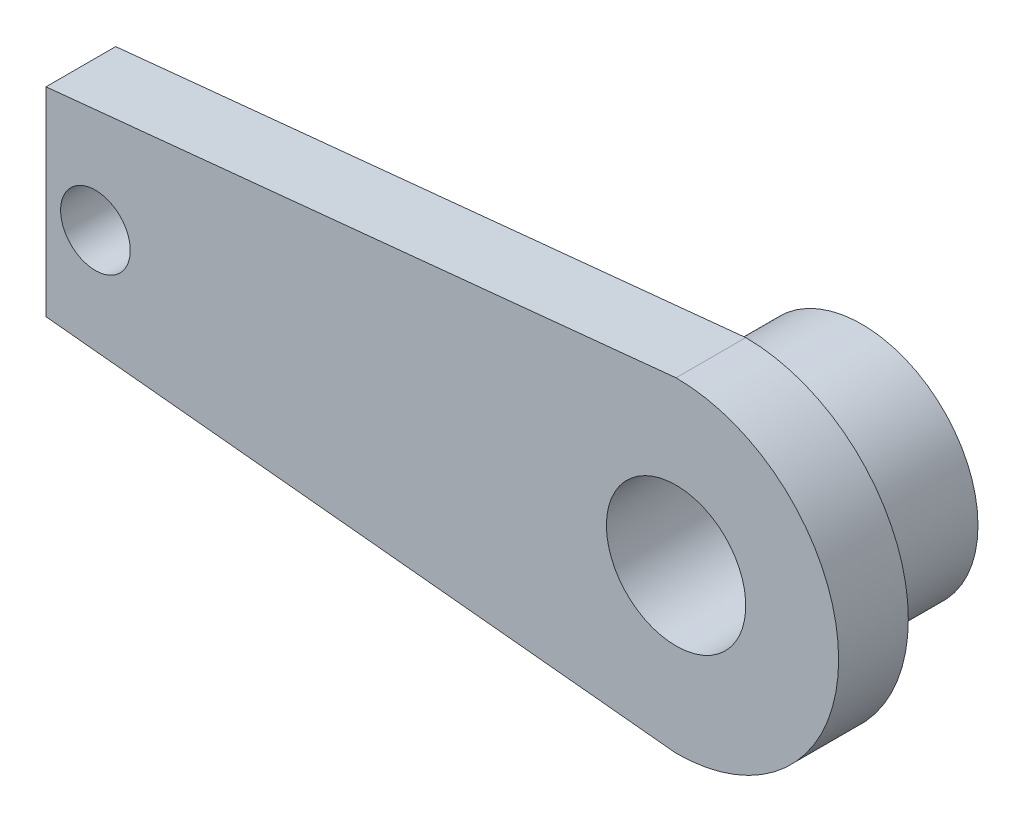
ISO-10303-21;
HEADER;
FILE_DESCRIPTION(('STEP AP214'),'2;1');
FILE_NAME('part.step','',(''),(''),'','','');
FILE_SCHEMA(('AUTOMOTIVE_DESIGN { 1 0 10303 214 1 1 1 1 }'));
ENDSEC;
DATA;
#1=APPLICATION_CONTEXT('core data for automotive mechanical design processes');
#2=APPLICATION_PROTOCOL_DEFINITION('international standard','automotive_design',2000,#1);
#3=PRODUCT_CONTEXT('',#1,'mechanical');
#4=PRODUCT('Part','Part','',(#3));
#5=PRODUCT_RELATED_PRODUCT_CATEGORY('part','',(#4));
#6=PRODUCT_DEFINITION_FORMATION('','',#4);
#7=PRODUCT_DEFINITION_CONTEXT('part definition',#1,'design');
#8=PRODUCT_DEFINITION('design','',#6,#7);
#9=PRODUCT_DEFINITION_SHAPE('','',#8);
#10=(LENGTH_UNIT() NAMED_UNIT(*) SI_UNIT(.MILLI.,.METRE.));
#11=(NAMED_UNIT(*) PLANE_ANGLE_UNIT() SI_UNIT($,.RADIAN.));
#12=(NAMED_UNIT(*) SI_UNIT($,.STERADIAN.) SOLID_ANGLE_UNIT());
#13=UNCERTAINTY_MEASURE_WITH_UNIT(LENGTH_MEASURE(1.E-05),#10,'distance_accuracy_value','');
#14=(GEOMETRIC_REPRESENTATION_CONTEXT(3) GLOBAL_UNCERTAINTY_ASSIGNED_CONTEXT((#13)) GLOBAL_UNIT_ASSIGNED_CONTEXT((#10,
#11,#12)) REPRESENTATION_CONTEXT('',''));
#15=CARTESIAN_POINT('',(0.,0.,0.));
#16=DIRECTION('',(0.,0.,1.));
#17=DIRECTION('',(1.,0.,0.));
#18=AXIS2_PLACEMENT_3D('',#15,#16,#17);
#19=CARTESIAN_POINT('',(-30.,-4.,8.));
#20=DIRECTION('',(0.099503719020999,0.995037190209989,0.));
#21=DIRECTION('',(-0.995037190209989,0.099503719020999,0.));
#22=AXIS2_PLACEMENT_3D('',#19,#20,#21);
#23=PLANE('',#22);
#24=DIRECTION('',(0.,0.,-1.));
#25=VECTOR('',#24,1.);
#26=CARTESIAN_POINT('',(-27.1280270584127,-4.28719729415873,15.));
#27=LINE('',#26,#25);
#28=CARTESIAN_POINT('',(-27.1280270584127,-4.28719729415873,8.));
#29=VERTEX_POINT('',#28);
#30=CARTESIAN_POINT('',(-27.1280270584127,-4.28719729415873,5.));
#31=VERTEX_POINT('',#30);
#32=EDGE_CURVE('E151',#29,#31,#27,.T.);
#33=ORIENTED_EDGE('',*,*,#32,.T.);
#34=DIRECTION('',(0.995037190209989,-0.0995037190209989,0.));
#35=VECTOR('',#34,1.);
#36=CARTESIAN_POINT('',(-30.,-4.,5.));
#37=LINE('',#36,#35);
#38=CARTESIAN_POINT('',(0.,-7.,5.));
#39=VERTEX_POINT('',#38);
#40=EDGE_CURVE('E80',#31,#39,#37,.T.);
#41=ORIENTED_EDGE('',*,*,#40,.T.);
#42=DIRECTION('',(0.,0.,-1.));
#43=VECTOR('',#42,1.);
#44=CARTESIAN_POINT('',(0.,-7.,8.));
#45=LINE('',#44,#43);
#46=CARTESIAN_POINT('',(0.,-7.,8.));
#47=VERTEX_POINT('',#46);
#48=EDGE_CURVE('E75',#47,#39,#45,.T.);
#49=ORIENTED_EDGE('',*,*,#48,.F.);
#50=DIRECTION('',(0.995037190209989,-0.0995037190209989,0.));
#51=VECTOR('',#50,1.);
#52=CARTESIAN_POINT('',(-30.,-4.,8.));
#53=LINE('',#52,#51);
#54=EDGE_CURVE('E89',#29,#47,#53,.T.);
#55=ORIENTED_EDGE('',*,*,#54,.F.);
#56=EDGE_LOOP('',(#33,#41,#49,#55));
#57=FACE_BOUND('',#56,.T.);
#58=ADVANCED_FACE('F32',(#57),#23,.F.);
#59=CARTESIAN_POINT('',(-30.,4.,8.));
#60=DIRECTION('',(0.099503719020999,-0.995037190209989,0.));
#61=DIRECTION('',(0.995037190209989,0.099503719020999,0.));
#62=AXIS2_PLACEMENT_3D('',#59,#60,#61);
#63=PLANE('',#62);
#64=DIRECTION('',(0.,0.,-1.));
#65=VECTOR('',#64,1.);
#66=CARTESIAN_POINT('',(-27.1280270584127,4.28719729415873,15.));
#67=LINE('',#66,#65);
#68=CARTESIAN_POINT('',(-27.1280270584127,4.28719729415873,8.));
#69=VERTEX_POINT('',#68);
#70=CARTESIAN_POINT('',(-27.1280270584127,4.28719729415873,5.));
#71=VERTEX_POINT('',#70);
#72=EDGE_CURVE('E47',#69,#71,#67,.T.);
#73=ORIENTED_EDGE('',*,*,#72,.F.);
#74=DIRECTION('',(-0.995037190209989,-0.0995037190209989,0.));
#75=VECTOR('',#74,1.);
#76=CARTESIAN_POINT('',(-30.,4.,8.));
#77=LINE('',#76,#75);
#78=CARTESIAN_POINT('',(0.,7.,8.));
#79=VERTEX_POINT('',#78);
#80=EDGE_CURVE('E85',#79,#69,#77,.T.);
#81=ORIENTED_EDGE('',*,*,#80,.F.);
#82=DIRECTION('',(0.,0.,-1.));
#83=VECTOR('',#82,1.);
#84=CARTESIAN_POINT('',(0.,7.,8.));
#85=LINE('',#84,#83);
#86=CARTESIAN_POINT('',(0.,7.,5.));
#87=VERTEX_POINT('',#86);
#88=EDGE_CURVE('E72',#79,#87,#85,.T.);
#89=ORIENTED_EDGE('',*,*,#88,.T.);
#90=DIRECTION('',(-0.995037190209989,-0.0995037190209989,0.));
#91=VECTOR('',#90,1.);
#92=CARTESIAN_POINT('',(-30.,4.,5.));
#93=LINE('',#92,#91);
#94=EDGE_CURVE('E79',#87,#71,#93,.T.);
#95=ORIENTED_EDGE('',*,*,#94,.T.);
#96=EDGE_LOOP('',(#73,#81,#89,#95));
#97=FACE_BOUND('',#96,.T.);
#98=ADVANCED_FACE('F84',(#97),#63,.F.);
#99=CARTESIAN_POINT('',(-30.,0.,8.));
#100=DIRECTION('',(0.,0.,1.));
#101=DIRECTION('',(1.,0.,0.));
#102=AXIS2_PLACEMENT_3D('',#99,#100,#101);
#103=PLANE('',#102);
#104=CARTESIAN_POINT('',(0.,0.,8.));
#105=DIRECTION('',(0.,0.,-1.));
#106=DIRECTION('',(-1.,0.,0.));
#107=AXIS2_PLACEMENT_3D('',#104,#105,#106);
#108=CIRCLE('',#107,3.);
#109=CARTESIAN_POINT('',(-3.,0.,8.));
#110=VERTEX_POINT('',#109);
#111=EDGE_CURVE('E133',#110,#110,#108,.T.);
#112=ORIENTED_EDGE('',*,*,#111,.T.);
#113=EDGE_LOOP('',(#112));
#114=FACE_BOUND('',#113,.T.);
#115=CARTESIAN_POINT('',(-25.,0.,8.));
#116=DIRECTION('',(0.,0.,-1.));
#117=DIRECTION('',(-1.,0.,0.));
#118=AXIS2_PLACEMENT_3D('',#115,#116,#117);
#119=CIRCLE('',#118,1.5);
#120=CARTESIAN_POINT('',(-26.5,0.,8.));
#121=VERTEX_POINT('',#120);
#122=EDGE_CURVE('E139',#121,#121,#119,.T.);
#123=ORIENTED_EDGE('',*,*,#122,.T.);
#124=EDGE_LOOP('',(#123));
#125=FACE_BOUND('',#124,.T.);
#126=ORIENTED_EDGE('',*,*,#80,.T.);
#127=DIRECTION('',(0.,-1.,0.));
#128=VECTOR('',#127,1.);
#129=CARTESIAN_POINT('',(-27.1280270584127,0.,8.));
#130=LINE('',#129,#128);
#131=EDGE_CURVE('E136',#69,#29,#130,.T.);
#132=ORIENTED_EDGE('',*,*,#131,.T.);
#133=ORIENTED_EDGE('',*,*,#54,.T.);
#134=CARTESIAN_POINT('',(0.,0.,8.));
#135=DIRECTION('',(0.,0.,1.));
#136=DIRECTION('',(1.,0.,0.));
#137=AXIS2_PLACEMENT_3D('',#134,#135,#136);
#138=CIRCLE('',#137,7.);
#139=EDGE_CURVE('E56',#47,#79,#138,.T.);
#140=ORIENTED_EDGE('',*,*,#139,.T.);
#141=EDGE_LOOP('',(#126,#132,#133,#140));
#142=FACE_BOUND('',#141,.T.);
#143=ADVANCED_FACE('F111',(#114,#125,#142),#103,.T.);
#144=CARTESIAN_POINT('',(-30.,0.,5.));
#145=DIRECTION('',(0.,0.,1.));
#146=DIRECTION('',(1.,0.,0.));
#147=AXIS2_PLACEMENT_3D('',#144,#145,#146);
#148=PLANE('',#147);
#149=CARTESIAN_POINT('',(0.,0.,5.));
#150=DIRECTION('',(0.,0.,1.));
#151=DIRECTION('',(1.,0.,0.));
#152=AXIS2_PLACEMENT_3D('',#149,#150,#151);
#153=CIRCLE('',#152,5.);
#154=CARTESIAN_POINT('',(5.,0.,5.));
#155=VERTEX_POINT('',#154);
#156=EDGE_CURVE('E11',#155,#155,#153,.T.);
#157=ORIENTED_EDGE('',*,*,#156,.T.);
#158=EDGE_LOOP('',(#157));
#159=FACE_BOUND('',#158,.T.);
#160=CARTESIAN_POINT('',(-25.,0.,5.));
#161=DIRECTION('',(0.,0.,-1.));
#162=DIRECTION('',(-1.,0.,0.));
#163=AXIS2_PLACEMENT_3D('',#160,#161,#162);
#164=CIRCLE('',#163,1.5);
#165=CARTESIAN_POINT('',(-26.5,0.,5.));
#166=VERTEX_POINT('',#165);
#167=EDGE_CURVE('E135',#166,#166,#164,.T.);
#168=ORIENTED_EDGE('',*,*,#167,.F.);
#169=EDGE_LOOP('',(#168));
#170=FACE_BOUND('',#169,.T.);
#171=DIRECTION('',(0.,1.,0.));
#172=VECTOR('',#171,1.);
#173=CARTESIAN_POINT('',(-27.1280270584127,0.,5.));
#174=LINE('',#173,#172);
#175=EDGE_CURVE('E88',#31,#71,#174,.T.);
#176=ORIENTED_EDGE('',*,*,#175,.T.);
#177=ORIENTED_EDGE('',*,*,#94,.F.);
#178=CARTESIAN_POINT('',(0.,0.,5.));
#179=DIRECTION('',(0.,0.,1.));
#180=DIRECTION('',(1.,0.,0.));
#181=AXIS2_PLACEMENT_3D('',#178,#179,#180);
#182=CIRCLE('',#181,7.);
#183=EDGE_CURVE('E69',#39,#87,#182,.T.);
#184=ORIENTED_EDGE('',*,*,#183,.F.);
#185=ORIENTED_EDGE('',*,*,#40,.F.);
#186=EDGE_LOOP('',(#176,#177,#184,#185));
#187=FACE_BOUND('',#186,.T.);
#188=ADVANCED_FACE('F87',(#159,#170,#187),#148,.F.);
#189=CARTESIAN_POINT('',(0.,0.,0.));
#190=DIRECTION('',(0.,0.,1.));
#191=DIRECTION('',(1.,0.,0.));
#192=AXIS2_PLACEMENT_3D('',#189,#190,#191);
#193=PLANE('',#192);
#194=CARTESIAN_POINT('',(0.,0.,0.));
#195=DIRECTION('',(0.,0.,1.));
#196=DIRECTION('',(1.,0.,0.));
#197=AXIS2_PLACEMENT_3D('',#194,#195,#196);
#198=CIRCLE('',#197,5.);
#199=CARTESIAN_POINT('',(5.,0.,0.));
#200=VERTEX_POINT('',#199);
#201=EDGE_CURVE('E36',#200,#200,#198,.T.);
#202=ORIENTED_EDGE('',*,*,#201,.F.);
#203=EDGE_LOOP('',(#202));
#204=FACE_BOUND('',#203,.T.);
#205=CARTESIAN_POINT('',(0.,0.,0.));
#206=DIRECTION('',(0.,0.,1.));
#207=DIRECTION('',(1.,0.,0.));
#208=AXIS2_PLACEMENT_3D('',#205,#206,#207);
#209=CIRCLE('',#208,3.);
#210=CARTESIAN_POINT('',(3.,0.,0.));
#211=VERTEX_POINT('',#210);
#212=EDGE_CURVE('E95',#211,#211,#209,.T.);
#213=ORIENTED_EDGE('',*,*,#212,.T.);
#214=EDGE_LOOP('',(#213));
#215=FACE_BOUND('',#214,.T.);
#216=ADVANCED_FACE('F103',(#204,#215),#193,.F.);
#217=CARTESIAN_POINT('',(0.,0.,5.));
#218=DIRECTION('',(0.,0.,-1.));
#219=DIRECTION('',(-1.,0.,0.));
#220=AXIS2_PLACEMENT_3D('',#217,#218,#219);
#221=CYLINDRICAL_SURFACE('',#220,5.);
#222=ORIENTED_EDGE('',*,*,#156,.F.);
#223=EDGE_LOOP('',(#222));
#224=FACE_BOUND('',#223,.T.);
#225=ORIENTED_EDGE('',*,*,#201,.T.);
#226=EDGE_LOOP('',(#225));
#227=FACE_BOUND('',#226,.T.);
#228=ADVANCED_FACE('F34',(#224,#227),#221,.T.);
#229=CARTESIAN_POINT('',(0.,0.,5.));
#230=DIRECTION('',(0.,0.,-1.));
#231=DIRECTION('',(-1.,0.,0.));
#232=AXIS2_PLACEMENT_3D('',#229,#230,#231);
#233=CYLINDRICAL_SURFACE('',#232,3.);
#234=ORIENTED_EDGE('',*,*,#212,.F.);
#235=EDGE_LOOP('',(#234));
#236=FACE_BOUND('',#235,.T.);
#237=ORIENTED_EDGE('',*,*,#111,.F.);
#238=EDGE_LOOP('',(#237));
#239=FACE_BOUND('',#238,.T.);
#240=ADVANCED_FACE('F109',(#236,#239),#233,.F.);
#241=CARTESIAN_POINT('',(0.,0.,8.));
#242=DIRECTION('',(0.,0.,-1.));
#243=DIRECTION('',(-1.,0.,0.));
#244=AXIS2_PLACEMENT_3D('',#241,#242,#243);
#245=CYLINDRICAL_SURFACE('',#244,7.);
#246=ORIENTED_EDGE('',*,*,#183,.T.);
#247=ORIENTED_EDGE('',*,*,#88,.F.);
#248=ORIENTED_EDGE('',*,*,#139,.F.);
#249=ORIENTED_EDGE('',*,*,#48,.T.);
#250=EDGE_LOOP('',(#246,#247,#248,#249));
#251=FACE_BOUND('',#250,.T.);
#252=ADVANCED_FACE('F71',(#251),#245,.T.);
#253=CARTESIAN_POINT('',(-25.,0.,8.));
#254=DIRECTION('',(0.,0.,-1.));
#255=DIRECTION('',(-1.,0.,0.));
#256=AXIS2_PLACEMENT_3D('',#253,#254,#255);
#257=CYLINDRICAL_SURFACE('',#256,1.5);
#258=ORIENTED_EDGE('',*,*,#122,.F.);
#259=EDGE_LOOP('',(#258));
#260=FACE_BOUND('',#259,.T.);
#261=ORIENTED_EDGE('',*,*,#167,.T.);
#262=EDGE_LOOP('',(#261));
#263=FACE_BOUND('',#262,.T.);
#264=ADVANCED_FACE('F129',(#260,#263),#257,.F.);
#265=CARTESIAN_POINT('',(-27.1280270584127,0.,15.));
#266=DIRECTION('',(-1.,0.,0.));
#267=DIRECTION('',(0.,0.,1.));
#268=AXIS2_PLACEMENT_3D('',#265,#266,#267);
#269=PLANE('',#268);
#270=ORIENTED_EDGE('',*,*,#72,.T.);
#271=ORIENTED_EDGE('',*,*,#175,.F.);
#272=ORIENTED_EDGE('',*,*,#32,.F.);
#273=ORIENTED_EDGE('',*,*,#131,.F.);
#274=EDGE_LOOP('',(#270,#271,#272,#273));
#275=FACE_BOUND('',#274,.T.);
#276=ADVANCED_FACE('F155',(#275),#269,.T.);
#277=CLOSED_SHELL('',(#58,#98,#143,#188,#216,#228,#240,#252,#264,#276));
#278=MANIFOLD_SOLID_BREP('B2',#277);
#279=ADVANCED_BREP_SHAPE_REPRESENTATION('',(#18,#278),#14);
#280=SHAPE_DEFINITION_REPRESENTATION(#9,#279);
ENDSEC;
END-ISO-10303-21;
